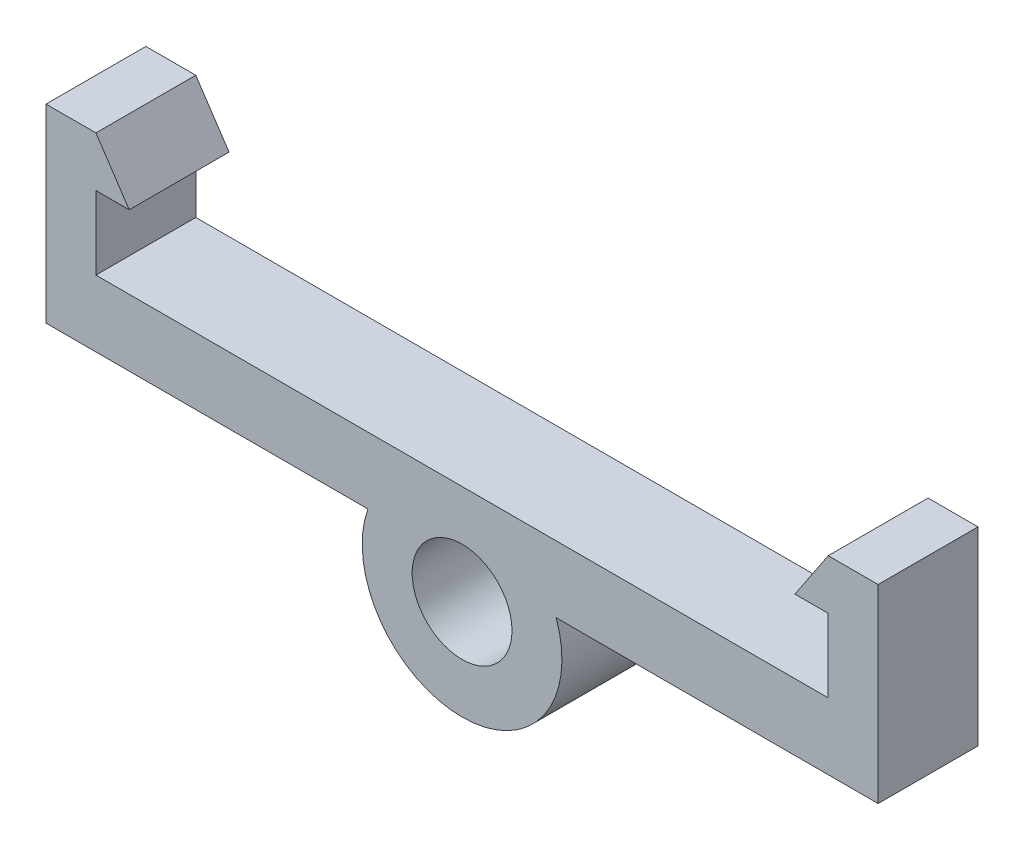
ISO-10303-21;
HEADER;
FILE_DESCRIPTION(('STEP AP214'),'2;1');
FILE_NAME('part.step','',(''),(''),'','','');
FILE_SCHEMA(('AUTOMOTIVE_DESIGN { 1 0 10303 214 1 1 1 1 }'));
ENDSEC;
DATA;
#1=APPLICATION_CONTEXT('core data for automotive mechanical design processes');
#2=APPLICATION_PROTOCOL_DEFINITION('international standard','automotive_design',2000,#1);
#3=PRODUCT_CONTEXT('',#1,'mechanical');
#4=PRODUCT('Part','Part','',(#3));
#5=PRODUCT_RELATED_PRODUCT_CATEGORY('part','',(#4));
#6=PRODUCT_DEFINITION_FORMATION('','',#4);
#7=PRODUCT_DEFINITION_CONTEXT('part definition',#1,'design');
#8=PRODUCT_DEFINITION('design','',#6,#7);
#9=PRODUCT_DEFINITION_SHAPE('','',#8);
#10=(LENGTH_UNIT() NAMED_UNIT(*) SI_UNIT(.MILLI.,.METRE.));
#11=(NAMED_UNIT(*) PLANE_ANGLE_UNIT() SI_UNIT($,.RADIAN.));
#12=(NAMED_UNIT(*) SI_UNIT($,.STERADIAN.) SOLID_ANGLE_UNIT());
#13=UNCERTAINTY_MEASURE_WITH_UNIT(LENGTH_MEASURE(1.E-05),#10,'distance_accuracy_value','');
#14=(GEOMETRIC_REPRESENTATION_CONTEXT(3) GLOBAL_UNCERTAINTY_ASSIGNED_CONTEXT((#13)) GLOBAL_UNIT_ASSIGNED_CONTEXT((#10,
#11,#12)) REPRESENTATION_CONTEXT('',''));
#15=CARTESIAN_POINT('',(0.,0.,0.));
#16=DIRECTION('',(0.,0.,1.));
#17=DIRECTION('',(1.,0.,0.));
#18=AXIS2_PLACEMENT_3D('',#15,#16,#17);
#19=CARTESIAN_POINT('',(0.,-1.5,1.5));
#20=DIRECTION('',(0.,0.,1.));
#21=DIRECTION('',(1.,0.,0.));
#22=AXIS2_PLACEMENT_3D('',#19,#20,#21);
#23=PLANE('',#22);
#24=DIRECTION('',(-0.55470019622523,-0.832050294337843,0.));
#25=VECTOR('',#24,1.);
#26=CARTESIAN_POINT('',(10.,3.7,1.5));
#27=LINE('',#26,#25);
#28=CARTESIAN_POINT('',(11.,5.2,1.5));
#29=VERTEX_POINT('',#28);
#30=CARTESIAN_POINT('',(10.,3.7,1.5));
#31=VERTEX_POINT('',#30);
#32=EDGE_CURVE('E193',#29,#31,#27,.T.);
#33=ORIENTED_EDGE('',*,*,#32,.T.);
#34=DIRECTION('',(1.,0.,0.));
#35=VECTOR('',#34,1.);
#36=CARTESIAN_POINT('',(11.,3.7,1.5));
#37=LINE('',#36,#35);
#38=CARTESIAN_POINT('',(11.,3.7,1.5));
#39=VERTEX_POINT('',#38);
#40=EDGE_CURVE('E111',#31,#39,#37,.T.);
#41=ORIENTED_EDGE('',*,*,#40,.T.);
#42=DIRECTION('',(0.,-1.,0.));
#43=VECTOR('',#42,1.);
#44=CARTESIAN_POINT('',(11.,1.5,1.5));
#45=LINE('',#44,#43);
#46=CARTESIAN_POINT('',(11.,1.5,1.5));
#47=VERTEX_POINT('',#46);
#48=EDGE_CURVE('E226',#39,#47,#45,.T.);
#49=ORIENTED_EDGE('',*,*,#48,.T.);
#50=DIRECTION('',(-1.,0.,0.));
#51=VECTOR('',#50,1.);
#52=CARTESIAN_POINT('',(11.,1.5,1.5));
#53=LINE('',#52,#51);
#54=CARTESIAN_POINT('',(-11.,1.5,1.5));
#55=VERTEX_POINT('',#54);
#56=EDGE_CURVE('E245',#47,#55,#53,.T.);
#57=ORIENTED_EDGE('',*,*,#56,.T.);
#58=DIRECTION('',(0.,1.,0.));
#59=VECTOR('',#58,1.);
#60=CARTESIAN_POINT('',(-11.,1.5,1.5));
#61=LINE('',#60,#59);
#62=CARTESIAN_POINT('',(-11.,3.7,1.5));
#63=VERTEX_POINT('',#62);
#64=EDGE_CURVE('E242',#55,#63,#61,.T.);
#65=ORIENTED_EDGE('',*,*,#64,.T.);
#66=DIRECTION('',(1.,0.,0.));
#67=VECTOR('',#66,1.);
#68=CARTESIAN_POINT('',(-11.,3.7,1.5));
#69=LINE('',#68,#67);
#70=CARTESIAN_POINT('',(-10.,3.7,1.5));
#71=VERTEX_POINT('',#70);
#72=EDGE_CURVE('E244',#63,#71,#69,.T.);
#73=ORIENTED_EDGE('',*,*,#72,.T.);
#74=DIRECTION('',(-0.55470019622523,0.832050294337843,0.));
#75=VECTOR('',#74,1.);
#76=CARTESIAN_POINT('',(-10.,3.7,1.5));
#77=LINE('',#76,#75);
#78=CARTESIAN_POINT('',(-11.,5.2,1.5));
#79=VERTEX_POINT('',#78);
#80=EDGE_CURVE('E247',#71,#79,#77,.T.);
#81=ORIENTED_EDGE('',*,*,#80,.T.);
#82=DIRECTION('',(-1.,0.,0.));
#83=VECTOR('',#82,1.);
#84=CARTESIAN_POINT('',(-11.,5.2,1.5));
#85=LINE('',#84,#83);
#86=CARTESIAN_POINT('',(-12.5,5.2,1.5));
#87=VERTEX_POINT('',#86);
#88=EDGE_CURVE('E253',#79,#87,#85,.T.);
#89=ORIENTED_EDGE('',*,*,#88,.T.);
#90=DIRECTION('',(0.,-1.,0.));
#91=VECTOR('',#90,1.);
#92=CARTESIAN_POINT('',(-12.5,5.2,1.5));
#93=LINE('',#92,#91);
#94=CARTESIAN_POINT('',(-12.5,-0.500000000000002,1.5));
#95=VERTEX_POINT('',#94);
#96=EDGE_CURVE('E255',#87,#95,#93,.T.);
#97=ORIENTED_EDGE('',*,*,#96,.T.);
#98=DIRECTION('',(1.,0.,0.));
#99=VECTOR('',#98,1.);
#100=CARTESIAN_POINT('',(-12.5,-0.500000000000002,1.5));
#101=LINE('',#100,#99);
#102=CARTESIAN_POINT('',(-2.82842712474619,-0.500000000000002,1.5));
#103=VERTEX_POINT('',#102);
#104=EDGE_CURVE('E257',#95,#103,#101,.T.);
#105=ORIENTED_EDGE('',*,*,#104,.T.);
#106=CARTESIAN_POINT('',(0.,-1.5,1.5));
#107=DIRECTION('',(0.,0.,1.));
#108=DIRECTION('',(1.,0.,0.));
#109=AXIS2_PLACEMENT_3D('',#106,#107,#108);
#110=CIRCLE('',#109,3.);
#111=CARTESIAN_POINT('',(2.82842712474619,-0.500000000000002,1.5));
#112=VERTEX_POINT('',#111);
#113=EDGE_CURVE('E148',#103,#112,#110,.T.);
#114=ORIENTED_EDGE('',*,*,#113,.T.);
#115=DIRECTION('',(1.,0.,0.));
#116=VECTOR('',#115,1.);
#117=CARTESIAN_POINT('',(2.82842712474619,-0.500000000000002,1.5));
#118=LINE('',#117,#116);
#119=CARTESIAN_POINT('',(12.5,-0.500000000000002,1.5));
#120=VERTEX_POINT('',#119);
#121=EDGE_CURVE('E142',#112,#120,#118,.T.);
#122=ORIENTED_EDGE('',*,*,#121,.T.);
#123=DIRECTION('',(0.,1.,0.));
#124=VECTOR('',#123,1.);
#125=CARTESIAN_POINT('',(12.5,5.2,1.5));
#126=LINE('',#125,#124);
#127=CARTESIAN_POINT('',(12.5,5.2,1.5));
#128=VERTEX_POINT('',#127);
#129=EDGE_CURVE('E146',#120,#128,#126,.T.);
#130=ORIENTED_EDGE('',*,*,#129,.T.);
#131=DIRECTION('',(-1.,0.,0.));
#132=VECTOR('',#131,1.);
#133=CARTESIAN_POINT('',(11.,5.2,1.5));
#134=LINE('',#133,#132);
#135=EDGE_CURVE('E50',#128,#29,#134,.T.);
#136=ORIENTED_EDGE('',*,*,#135,.T.);
#137=EDGE_LOOP('',(#33,#41,#49,#57,#65,#73,#81,#89,#97,#105,#114,#122,#130,#136));
#138=FACE_BOUND('',#137,.T.);
#139=CARTESIAN_POINT('',(0.,-1.5,1.5));
#140=DIRECTION('',(0.,0.,1.));
#141=DIRECTION('',(1.,0.,0.));
#142=AXIS2_PLACEMENT_3D('',#139,#140,#141);
#143=CIRCLE('',#142,1.5);
#144=CARTESIAN_POINT('',(1.5,-1.5,1.5));
#145=VERTEX_POINT('',#144);
#146=EDGE_CURVE('E170',#145,#145,#143,.T.);
#147=ORIENTED_EDGE('',*,*,#146,.F.);
#148=EDGE_LOOP('',(#147));
#149=FACE_BOUND('',#148,.T.);
#150=ADVANCED_FACE('F33',(#138,#149),#23,.T.);
#151=CARTESIAN_POINT('',(0.,-1.5,-1.5));
#152=DIRECTION('',(0.,0.,1.));
#153=DIRECTION('',(1.,0.,0.));
#154=AXIS2_PLACEMENT_3D('',#151,#152,#153);
#155=PLANE('',#154);
#156=DIRECTION('',(-0.55470019622523,-0.832050294337843,0.));
#157=VECTOR('',#156,1.);
#158=CARTESIAN_POINT('',(10.,3.7,-1.5));
#159=LINE('',#158,#157);
#160=CARTESIAN_POINT('',(11.,5.2,-1.5));
#161=VERTEX_POINT('',#160);
#162=CARTESIAN_POINT('',(10.,3.7,-1.5));
#163=VERTEX_POINT('',#162);
#164=EDGE_CURVE('E166',#161,#163,#159,.T.);
#165=ORIENTED_EDGE('',*,*,#164,.F.);
#166=DIRECTION('',(-1.,0.,0.));
#167=VECTOR('',#166,1.);
#168=CARTESIAN_POINT('',(11.,5.2,-1.5));
#169=LINE('',#168,#167);
#170=CARTESIAN_POINT('',(12.5,5.2,-1.5));
#171=VERTEX_POINT('',#170);
#172=EDGE_CURVE('E103',#171,#161,#169,.T.);
#173=ORIENTED_EDGE('',*,*,#172,.F.);
#174=DIRECTION('',(0.,1.,0.));
#175=VECTOR('',#174,1.);
#176=CARTESIAN_POINT('',(12.5,5.2,-1.5));
#177=LINE('',#176,#175);
#178=CARTESIAN_POINT('',(12.5,-0.500000000000002,-1.5));
#179=VERTEX_POINT('',#178);
#180=EDGE_CURVE('E97',#179,#171,#177,.T.);
#181=ORIENTED_EDGE('',*,*,#180,.F.);
#182=DIRECTION('',(1.,0.,0.));
#183=VECTOR('',#182,1.);
#184=CARTESIAN_POINT('',(2.82842712474619,-0.500000000000002,-1.5));
#185=LINE('',#184,#183);
#186=CARTESIAN_POINT('',(2.82842712474619,-0.500000000000002,-1.5));
#187=VERTEX_POINT('',#186);
#188=EDGE_CURVE('E156',#187,#179,#185,.T.);
#189=ORIENTED_EDGE('',*,*,#188,.F.);
#190=CARTESIAN_POINT('',(0.,-1.5,-1.5));
#191=DIRECTION('',(0.,0.,1.));
#192=DIRECTION('',(1.,0.,0.));
#193=AXIS2_PLACEMENT_3D('',#190,#191,#192);
#194=CIRCLE('',#193,3.);
#195=CARTESIAN_POINT('',(-2.82842712474619,-0.500000000000002,-1.5));
#196=VERTEX_POINT('',#195);
#197=EDGE_CURVE('E188',#196,#187,#194,.T.);
#198=ORIENTED_EDGE('',*,*,#197,.F.);
#199=DIRECTION('',(1.,0.,0.));
#200=VECTOR('',#199,1.);
#201=CARTESIAN_POINT('',(-12.5,-0.500000000000002,-1.5));
#202=LINE('',#201,#200);
#203=CARTESIAN_POINT('',(-12.5,-0.500000000000002,-1.5));
#204=VERTEX_POINT('',#203);
#205=EDGE_CURVE('E186',#204,#196,#202,.T.);
#206=ORIENTED_EDGE('',*,*,#205,.F.);
#207=DIRECTION('',(0.,-1.,0.));
#208=VECTOR('',#207,1.);
#209=CARTESIAN_POINT('',(-12.5,5.2,-1.5));
#210=LINE('',#209,#208);
#211=CARTESIAN_POINT('',(-12.5,5.2,-1.5));
#212=VERTEX_POINT('',#211);
#213=EDGE_CURVE('E184',#212,#204,#210,.T.);
#214=ORIENTED_EDGE('',*,*,#213,.F.);
#215=DIRECTION('',(-1.,0.,0.));
#216=VECTOR('',#215,1.);
#217=CARTESIAN_POINT('',(-11.,5.2,-1.5));
#218=LINE('',#217,#216);
#219=CARTESIAN_POINT('',(-11.,5.2,-1.5));
#220=VERTEX_POINT('',#219);
#221=EDGE_CURVE('E182',#220,#212,#218,.T.);
#222=ORIENTED_EDGE('',*,*,#221,.F.);
#223=DIRECTION('',(-0.55470019622523,0.832050294337843,0.));
#224=VECTOR('',#223,1.);
#225=CARTESIAN_POINT('',(-10.,3.7,-1.5));
#226=LINE('',#225,#224);
#227=CARTESIAN_POINT('',(-10.,3.7,-1.5));
#228=VERTEX_POINT('',#227);
#229=EDGE_CURVE('E180',#228,#220,#226,.T.);
#230=ORIENTED_EDGE('',*,*,#229,.F.);
#231=DIRECTION('',(1.,0.,0.));
#232=VECTOR('',#231,1.);
#233=CARTESIAN_POINT('',(-11.,3.7,-1.5));
#234=LINE('',#233,#232);
#235=CARTESIAN_POINT('',(-11.,3.7,-1.5));
#236=VERTEX_POINT('',#235);
#237=EDGE_CURVE('E178',#236,#228,#234,.T.);
#238=ORIENTED_EDGE('',*,*,#237,.F.);
#239=DIRECTION('',(0.,1.,0.));
#240=VECTOR('',#239,1.);
#241=CARTESIAN_POINT('',(-11.,1.5,-1.5));
#242=LINE('',#241,#240);
#243=CARTESIAN_POINT('',(-11.,1.5,-1.5));
#244=VERTEX_POINT('',#243);
#245=EDGE_CURVE('E176',#244,#236,#242,.T.);
#246=ORIENTED_EDGE('',*,*,#245,.F.);
#247=DIRECTION('',(-1.,0.,0.));
#248=VECTOR('',#247,1.);
#249=CARTESIAN_POINT('',(11.,1.5,-1.5));
#250=LINE('',#249,#248);
#251=CARTESIAN_POINT('',(11.,1.5,-1.5));
#252=VERTEX_POINT('',#251);
#253=EDGE_CURVE('E174',#252,#244,#250,.T.);
#254=ORIENTED_EDGE('',*,*,#253,.F.);
#255=DIRECTION('',(0.,-1.,0.));
#256=VECTOR('',#255,1.);
#257=CARTESIAN_POINT('',(11.,1.5,-1.5));
#258=LINE('',#257,#256);
#259=CARTESIAN_POINT('',(11.,3.7,-1.5));
#260=VERTEX_POINT('',#259);
#261=EDGE_CURVE('E172',#260,#252,#258,.T.);
#262=ORIENTED_EDGE('',*,*,#261,.F.);
#263=DIRECTION('',(1.,0.,0.));
#264=VECTOR('',#263,1.);
#265=CARTESIAN_POINT('',(11.,3.7,-1.5));
#266=LINE('',#265,#264);
#267=EDGE_CURVE('E169',#163,#260,#266,.T.);
#268=ORIENTED_EDGE('',*,*,#267,.F.);
#269=EDGE_LOOP('',(#165,#173,#181,#189,#198,#206,#214,#222,#230,#238,#246,#254,#262,#268));
#270=FACE_BOUND('',#269,.T.);
#271=CARTESIAN_POINT('',(0.,-1.5,-1.5));
#272=DIRECTION('',(0.,0.,1.));
#273=DIRECTION('',(1.,0.,0.));
#274=AXIS2_PLACEMENT_3D('',#271,#272,#273);
#275=CIRCLE('',#274,1.5);
#276=CARTESIAN_POINT('',(1.5,-1.5,-1.5));
#277=VERTEX_POINT('',#276);
#278=EDGE_CURVE('E430',#277,#277,#275,.T.);
#279=ORIENTED_EDGE('',*,*,#278,.T.);
#280=EDGE_LOOP('',(#279));
#281=FACE_BOUND('',#280,.T.);
#282=ADVANCED_FACE('F230',(#270,#281),#155,.F.);
#283=CARTESIAN_POINT('',(10.,3.7,1.5));
#284=DIRECTION('',(0.832050294337843,-0.554700196225229,0.));
#285=DIRECTION('',(0.55470019622523,0.832050294337843,0.));
#286=AXIS2_PLACEMENT_3D('',#283,#284,#285);
#287=PLANE('',#286);
#288=ORIENTED_EDGE('',*,*,#164,.T.);
#289=DIRECTION('',(0.,0.,-1.));
#290=VECTOR('',#289,1.);
#291=CARTESIAN_POINT('',(10.,3.7,1.5));
#292=LINE('',#291,#290);
#293=EDGE_CURVE('E11',#31,#163,#292,.T.);
#294=ORIENTED_EDGE('',*,*,#293,.F.);
#295=ORIENTED_EDGE('',*,*,#32,.F.);
#296=DIRECTION('',(0.,0.,-1.));
#297=VECTOR('',#296,1.);
#298=CARTESIAN_POINT('',(11.,5.2,1.5));
#299=LINE('',#298,#297);
#300=EDGE_CURVE('E162',#29,#161,#299,.T.);
#301=ORIENTED_EDGE('',*,*,#300,.T.);
#302=EDGE_LOOP('',(#288,#294,#295,#301));
#303=FACE_BOUND('',#302,.T.);
#304=ADVANCED_FACE('F35',(#303),#287,.F.);
#305=CARTESIAN_POINT('',(11.,3.7,1.5));
#306=DIRECTION('',(0.,1.,0.));
#307=DIRECTION('',(0.,0.,1.));
#308=AXIS2_PLACEMENT_3D('',#305,#306,#307);
#309=PLANE('',#308);
#310=ORIENTED_EDGE('',*,*,#267,.T.);
#311=DIRECTION('',(0.,0.,-1.));
#312=VECTOR('',#311,1.);
#313=CARTESIAN_POINT('',(11.,3.7,1.5));
#314=LINE('',#313,#312);
#315=EDGE_CURVE('E42',#39,#260,#314,.T.);
#316=ORIENTED_EDGE('',*,*,#315,.F.);
#317=ORIENTED_EDGE('',*,*,#40,.F.);
#318=ORIENTED_EDGE('',*,*,#293,.T.);
#319=EDGE_LOOP('',(#310,#316,#317,#318));
#320=FACE_BOUND('',#319,.T.);
#321=ADVANCED_FACE('F291',(#320),#309,.F.);
#322=CARTESIAN_POINT('',(11.,1.5,1.5));
#323=DIRECTION('',(1.,0.,0.));
#324=DIRECTION('',(0.,1.,0.));
#325=AXIS2_PLACEMENT_3D('',#322,#323,#324);
#326=PLANE('',#325);
#327=ORIENTED_EDGE('',*,*,#261,.T.);
#328=DIRECTION('',(0.,0.,-1.));
#329=VECTOR('',#328,1.);
#330=CARTESIAN_POINT('',(11.,1.5,1.5));
#331=LINE('',#330,#329);
#332=EDGE_CURVE('E218',#47,#252,#331,.T.);
#333=ORIENTED_EDGE('',*,*,#332,.F.);
#334=ORIENTED_EDGE('',*,*,#48,.F.);
#335=ORIENTED_EDGE('',*,*,#315,.T.);
#336=EDGE_LOOP('',(#327,#333,#334,#335));
#337=FACE_BOUND('',#336,.T.);
#338=ADVANCED_FACE('F224',(#337),#326,.F.);
#339=CARTESIAN_POINT('',(11.,1.5,1.5));
#340=DIRECTION('',(0.,-1.,0.));
#341=DIRECTION('',(0.,0.,-1.));
#342=AXIS2_PLACEMENT_3D('',#339,#340,#341);
#343=PLANE('',#342);
#344=ORIENTED_EDGE('',*,*,#253,.T.);
#345=DIRECTION('',(0.,0.,-1.));
#346=VECTOR('',#345,1.);
#347=CARTESIAN_POINT('',(-11.,1.5,1.5));
#348=LINE('',#347,#346);
#349=EDGE_CURVE('E215',#55,#244,#348,.T.);
#350=ORIENTED_EDGE('',*,*,#349,.F.);
#351=ORIENTED_EDGE('',*,*,#56,.F.);
#352=ORIENTED_EDGE('',*,*,#332,.T.);
#353=EDGE_LOOP('',(#344,#350,#351,#352));
#354=FACE_BOUND('',#353,.T.);
#355=ADVANCED_FACE('F236',(#354),#343,.F.);
#356=CARTESIAN_POINT('',(-11.,1.5,1.5));
#357=DIRECTION('',(-1.,0.,0.));
#358=DIRECTION('',(0.,-1.,0.));
#359=AXIS2_PLACEMENT_3D('',#356,#357,#358);
#360=PLANE('',#359);
#361=ORIENTED_EDGE('',*,*,#245,.T.);
#362=DIRECTION('',(0.,0.,-1.));
#363=VECTOR('',#362,1.);
#364=CARTESIAN_POINT('',(-11.,3.7,1.5));
#365=LINE('',#364,#363);
#366=EDGE_CURVE('E212',#63,#236,#365,.T.);
#367=ORIENTED_EDGE('',*,*,#366,.F.);
#368=ORIENTED_EDGE('',*,*,#64,.F.);
#369=ORIENTED_EDGE('',*,*,#349,.T.);
#370=EDGE_LOOP('',(#361,#367,#368,#369));
#371=FACE_BOUND('',#370,.T.);
#372=ADVANCED_FACE('F240',(#371),#360,.F.);
#373=CARTESIAN_POINT('',(-11.,3.7,1.5));
#374=DIRECTION('',(0.,1.,0.));
#375=DIRECTION('',(0.,0.,1.));
#376=AXIS2_PLACEMENT_3D('',#373,#374,#375);
#377=PLANE('',#376);
#378=ORIENTED_EDGE('',*,*,#237,.T.);
#379=DIRECTION('',(0.,0.,-1.));
#380=VECTOR('',#379,1.);
#381=CARTESIAN_POINT('',(-10.,3.7,1.5));
#382=LINE('',#381,#380);
#383=EDGE_CURVE('E209',#71,#228,#382,.T.);
#384=ORIENTED_EDGE('',*,*,#383,.F.);
#385=ORIENTED_EDGE('',*,*,#72,.F.);
#386=ORIENTED_EDGE('',*,*,#366,.T.);
#387=EDGE_LOOP('',(#378,#384,#385,#386));
#388=FACE_BOUND('',#387,.T.);
#389=ADVANCED_FACE('F304',(#388),#377,.F.);
#390=CARTESIAN_POINT('',(-10.,3.7,1.5));
#391=DIRECTION('',(-0.832050294337843,-0.554700196225229,0.));
#392=DIRECTION('',(0.55470019622523,-0.832050294337843,0.));
#393=AXIS2_PLACEMENT_3D('',#390,#391,#392);
#394=PLANE('',#393);
#395=ORIENTED_EDGE('',*,*,#229,.T.);
#396=DIRECTION('',(0.,0.,-1.));
#397=VECTOR('',#396,1.);
#398=CARTESIAN_POINT('',(-11.,5.2,1.5));
#399=LINE('',#398,#397);
#400=EDGE_CURVE('E206',#79,#220,#399,.T.);
#401=ORIENTED_EDGE('',*,*,#400,.F.);
#402=ORIENTED_EDGE('',*,*,#80,.F.);
#403=ORIENTED_EDGE('',*,*,#383,.T.);
#404=EDGE_LOOP('',(#395,#401,#402,#403));
#405=FACE_BOUND('',#404,.T.);
#406=ADVANCED_FACE('F307',(#405),#394,.F.);
#407=CARTESIAN_POINT('',(-11.,5.2,1.5));
#408=DIRECTION('',(0.,-1.,0.));
#409=DIRECTION('',(0.,0.,-1.));
#410=AXIS2_PLACEMENT_3D('',#407,#408,#409);
#411=PLANE('',#410);
#412=ORIENTED_EDGE('',*,*,#221,.T.);
#413=DIRECTION('',(0.,0.,-1.));
#414=VECTOR('',#413,1.);
#415=CARTESIAN_POINT('',(-12.5,5.2,1.5));
#416=LINE('',#415,#414);
#417=EDGE_CURVE('E203',#87,#212,#416,.T.);
#418=ORIENTED_EDGE('',*,*,#417,.F.);
#419=ORIENTED_EDGE('',*,*,#88,.F.);
#420=ORIENTED_EDGE('',*,*,#400,.T.);
#421=EDGE_LOOP('',(#412,#418,#419,#420));
#422=FACE_BOUND('',#421,.T.);
#423=ADVANCED_FACE('F311',(#422),#411,.F.);
#424=CARTESIAN_POINT('',(-12.5,5.2,1.5));
#425=DIRECTION('',(1.,0.,0.));
#426=DIRECTION('',(0.,0.,-1.));
#427=AXIS2_PLACEMENT_3D('',#424,#425,#426);
#428=PLANE('',#427);
#429=ORIENTED_EDGE('',*,*,#213,.T.);
#430=DIRECTION('',(0.,0.,-1.));
#431=VECTOR('',#430,1.);
#432=CARTESIAN_POINT('',(-12.5,-0.500000000000002,1.5));
#433=LINE('',#432,#431);
#434=EDGE_CURVE('E200',#95,#204,#433,.T.);
#435=ORIENTED_EDGE('',*,*,#434,.F.);
#436=ORIENTED_EDGE('',*,*,#96,.F.);
#437=ORIENTED_EDGE('',*,*,#417,.T.);
#438=EDGE_LOOP('',(#429,#435,#436,#437));
#439=FACE_BOUND('',#438,.T.);
#440=ADVANCED_FACE('F315',(#439),#428,.F.);
#441=CARTESIAN_POINT('',(-12.5,-0.500000000000002,1.5));
#442=DIRECTION('',(0.,1.,0.));
#443=DIRECTION('',(-1.,0.,0.));
#444=AXIS2_PLACEMENT_3D('',#441,#442,#443);
#445=PLANE('',#444);
#446=ORIENTED_EDGE('',*,*,#205,.T.);
#447=DIRECTION('',(0.,0.,-1.));
#448=VECTOR('',#447,1.);
#449=CARTESIAN_POINT('',(-2.82842712474619,-0.500000000000002,1.5));
#450=LINE('',#449,#448);
#451=EDGE_CURVE('E197',#103,#196,#450,.T.);
#452=ORIENTED_EDGE('',*,*,#451,.F.);
#453=ORIENTED_EDGE('',*,*,#104,.F.);
#454=ORIENTED_EDGE('',*,*,#434,.T.);
#455=EDGE_LOOP('',(#446,#452,#453,#454));
#456=FACE_BOUND('',#455,.T.);
#457=ADVANCED_FACE('F263',(#456),#445,.F.);
#458=CARTESIAN_POINT('',(0.,-1.5,1.5));
#459=DIRECTION('',(0.,0.,-1.));
#460=DIRECTION('',(-1.,0.,0.));
#461=AXIS2_PLACEMENT_3D('',#458,#459,#460);
#462=CYLINDRICAL_SURFACE('',#461,3.);
#463=ORIENTED_EDGE('',*,*,#197,.T.);
#464=DIRECTION('',(0.,0.,-1.));
#465=VECTOR('',#464,1.);
#466=CARTESIAN_POINT('',(2.82842712474619,-0.500000000000002,1.5));
#467=LINE('',#466,#465);
#468=EDGE_CURVE('E157',#112,#187,#467,.T.);
#469=ORIENTED_EDGE('',*,*,#468,.F.);
#470=ORIENTED_EDGE('',*,*,#113,.F.);
#471=ORIENTED_EDGE('',*,*,#451,.T.);
#472=EDGE_LOOP('',(#463,#469,#470,#471));
#473=FACE_BOUND('',#472,.T.);
#474=ADVANCED_FACE('F267',(#473),#462,.T.);
#475=CARTESIAN_POINT('',(2.82842712474619,-0.500000000000002,1.5));
#476=DIRECTION('',(0.,1.,0.));
#477=DIRECTION('',(-1.,0.,0.));
#478=AXIS2_PLACEMENT_3D('',#475,#476,#477);
#479=PLANE('',#478);
#480=ORIENTED_EDGE('',*,*,#188,.T.);
#481=DIRECTION('',(0.,0.,-1.));
#482=VECTOR('',#481,1.);
#483=CARTESIAN_POINT('',(12.5,-0.500000000000002,1.5));
#484=LINE('',#483,#482);
#485=EDGE_CURVE('E153',#120,#179,#484,.T.);
#486=ORIENTED_EDGE('',*,*,#485,.F.);
#487=ORIENTED_EDGE('',*,*,#121,.F.);
#488=ORIENTED_EDGE('',*,*,#468,.T.);
#489=EDGE_LOOP('',(#480,#486,#487,#488));
#490=FACE_BOUND('',#489,.T.);
#491=ADVANCED_FACE('F154',(#490),#479,.F.);
#492=CARTESIAN_POINT('',(12.5,5.2,1.5));
#493=DIRECTION('',(-1.,0.,0.));
#494=DIRECTION('',(0.,0.,1.));
#495=AXIS2_PLACEMENT_3D('',#492,#493,#494);
#496=PLANE('',#495);
#497=ORIENTED_EDGE('',*,*,#180,.T.);
#498=DIRECTION('',(0.,0.,-1.));
#499=VECTOR('',#498,1.);
#500=CARTESIAN_POINT('',(12.5,5.2,1.5));
#501=LINE('',#500,#499);
#502=EDGE_CURVE('E158',#128,#171,#501,.T.);
#503=ORIENTED_EDGE('',*,*,#502,.F.);
#504=ORIENTED_EDGE('',*,*,#129,.F.);
#505=ORIENTED_EDGE('',*,*,#485,.T.);
#506=EDGE_LOOP('',(#497,#503,#504,#505));
#507=FACE_BOUND('',#506,.T.);
#508=ADVANCED_FACE('F160',(#507),#496,.F.);
#509=CARTESIAN_POINT('',(11.,5.2,1.5));
#510=DIRECTION('',(0.,-1.,0.));
#511=DIRECTION('',(0.,0.,-1.));
#512=AXIS2_PLACEMENT_3D('',#509,#510,#511);
#513=PLANE('',#512);
#514=ORIENTED_EDGE('',*,*,#172,.T.);
#515=ORIENTED_EDGE('',*,*,#300,.F.);
#516=ORIENTED_EDGE('',*,*,#135,.F.);
#517=ORIENTED_EDGE('',*,*,#502,.T.);
#518=EDGE_LOOP('',(#514,#515,#516,#517));
#519=FACE_BOUND('',#518,.T.);
#520=ADVANCED_FACE('F271',(#519),#513,.F.);
#521=CARTESIAN_POINT('',(0.,-1.5,1.5));
#522=DIRECTION('',(0.,0.,-1.));
#523=DIRECTION('',(-1.,0.,0.));
#524=AXIS2_PLACEMENT_3D('',#521,#522,#523);
#525=CYLINDRICAL_SURFACE('',#524,1.5);
#526=ORIENTED_EDGE('',*,*,#146,.T.);
#527=EDGE_LOOP('',(#526));
#528=FACE_BOUND('',#527,.T.);
#529=ORIENTED_EDGE('',*,*,#278,.F.);
#530=EDGE_LOOP('',(#529));
#531=FACE_BOUND('',#530,.T.);
#532=ADVANCED_FACE('F273',(#528,#531),#525,.F.);
#533=CLOSED_SHELL('',(#150,#282,#304,#321,#338,#355,#372,#389,#406,#423,#440,#457,#474,#491,
#508,#520,#532));
#534=MANIFOLD_SOLID_BREP('B2',#533);
#535=ADVANCED_BREP_SHAPE_REPRESENTATION('',(#18,#534),#14);
#536=SHAPE_DEFINITION_REPRESENTATION(#9,#535);
ENDSEC;
END-ISO-10303-21;
